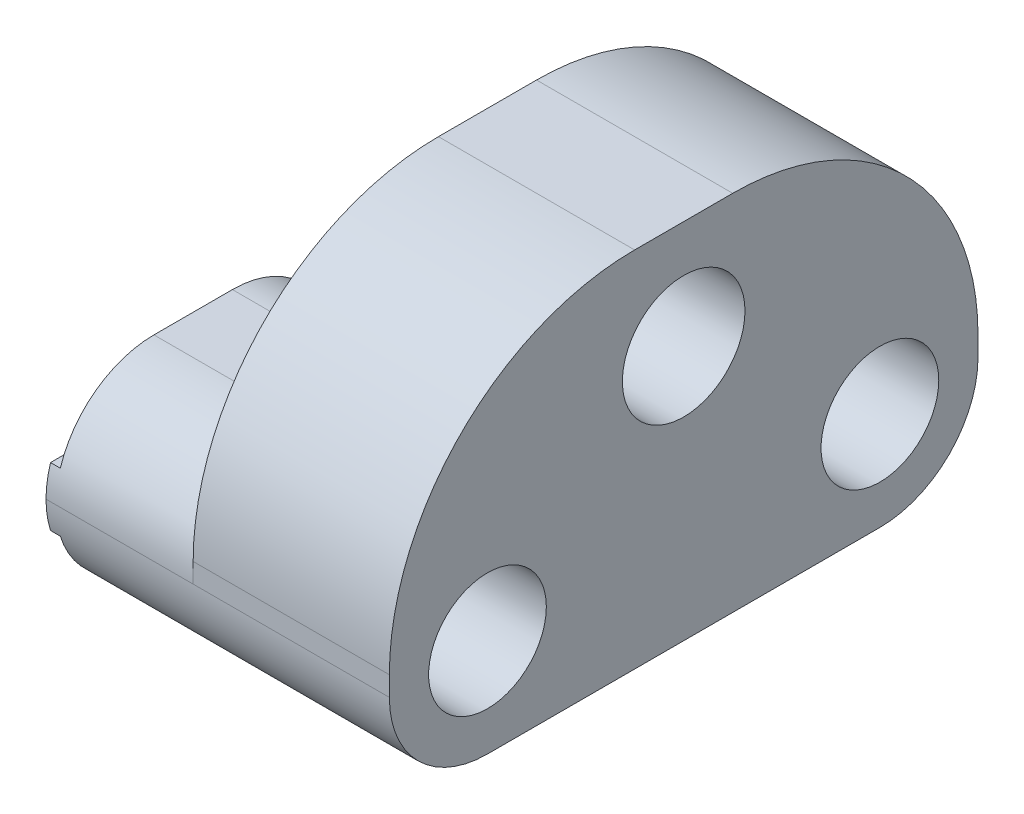
ISO-10303-21;
HEADER;
FILE_DESCRIPTION(('STEP AP214'),'2;1');
FILE_NAME('part.step','',(''),(''),'','','');
FILE_SCHEMA(('AUTOMOTIVE_DESIGN { 1 0 10303 214 1 1 1 1 }'));
ENDSEC;
DATA;
#1=APPLICATION_CONTEXT('core data for automotive mechanical design processes');
#2=APPLICATION_PROTOCOL_DEFINITION('international standard','automotive_design',2000,#1);
#3=PRODUCT_CONTEXT('',#1,'mechanical');
#4=PRODUCT('Part','Part','',(#3));
#5=PRODUCT_RELATED_PRODUCT_CATEGORY('part','',(#4));
#6=PRODUCT_DEFINITION_FORMATION('','',#4);
#7=PRODUCT_DEFINITION_CONTEXT('part definition',#1,'design');
#8=PRODUCT_DEFINITION('design','',#6,#7);
#9=PRODUCT_DEFINITION_SHAPE('','',#8);
#10=(LENGTH_UNIT() NAMED_UNIT(*) SI_UNIT(.MILLI.,.METRE.));
#11=(NAMED_UNIT(*) PLANE_ANGLE_UNIT() SI_UNIT($,.RADIAN.));
#12=(NAMED_UNIT(*) SI_UNIT($,.STERADIAN.) SOLID_ANGLE_UNIT());
#13=UNCERTAINTY_MEASURE_WITH_UNIT(LENGTH_MEASURE(1.E-05),#10,'distance_accuracy_value','');
#14=(GEOMETRIC_REPRESENTATION_CONTEXT(3) GLOBAL_UNCERTAINTY_ASSIGNED_CONTEXT((#13)) GLOBAL_UNIT_ASSIGNED_CONTEXT((#10,
#11,#12)) REPRESENTATION_CONTEXT('',''));
#15=CARTESIAN_POINT('',(0.,0.,0.));
#16=DIRECTION('',(0.,0.,1.));
#17=DIRECTION('',(1.,0.,0.));
#18=AXIS2_PLACEMENT_3D('',#15,#16,#17);
#19=CARTESIAN_POINT('',(0.,20.,60.));
#20=DIRECTION('',(0.,-1.,0.));
#21=DIRECTION('',(0.,0.,-1.));
#22=AXIS2_PLACEMENT_3D('',#19,#20,#21);
#23=PLANE('',#22);
#24=DIRECTION('',(0.,0.,-1.));
#25=VECTOR('',#24,1.);
#26=CARTESIAN_POINT('',(14.,20.,60.));
#27=LINE('',#26,#25);
#28=CARTESIAN_POINT('',(14.,20.,18.));
#29=VERTEX_POINT('',#28);
#30=CARTESIAN_POINT('',(14.,20.,10.));
#31=VERTEX_POINT('',#30);
#32=EDGE_CURVE('E311',#29,#31,#27,.T.);
#33=ORIENTED_EDGE('',*,*,#32,.T.);
#34=DIRECTION('',(-1.,0.,0.));
#35=VECTOR('',#34,1.);
#36=CARTESIAN_POINT('',(0.,20.,10.));
#37=LINE('',#36,#35);
#38=CARTESIAN_POINT('',(0.,20.,10.));
#39=VERTEX_POINT('',#38);
#40=EDGE_CURVE('E258',#31,#39,#37,.T.);
#41=ORIENTED_EDGE('',*,*,#40,.T.);
#42=DIRECTION('',(0.,0.,-1.));
#43=VECTOR('',#42,1.);
#44=CARTESIAN_POINT('',(0.,20.,60.));
#45=LINE('',#44,#43);
#46=CARTESIAN_POINT('',(0.,20.,18.));
#47=VERTEX_POINT('',#46);
#48=EDGE_CURVE('E361',#47,#39,#45,.T.);
#49=ORIENTED_EDGE('',*,*,#48,.F.);
#50=DIRECTION('',(-1.,0.,0.));
#51=VECTOR('',#50,1.);
#52=CARTESIAN_POINT('',(14.,20.,18.));
#53=LINE('',#52,#51);
#54=EDGE_CURVE('E210',#47,#29,#53,.F.);
#55=ORIENTED_EDGE('',*,*,#54,.T.);
#56=EDGE_LOOP('',(#33,#41,#49,#55));
#57=FACE_BOUND('',#56,.T.);
#58=ADVANCED_FACE('F39',(#57),#23,.F.);
#59=CARTESIAN_POINT('',(0.,20.,50.));
#60=VERTEX_POINT('',#59);
#61=CARTESIAN_POINT('',(0.,20.,42.));
#62=VERTEX_POINT('',#61);
#63=EDGE_CURVE('E177',#60,#62,#45,.T.);
#64=ORIENTED_EDGE('',*,*,#63,.F.);
#65=DIRECTION('',(-1.,0.,0.));
#66=VECTOR('',#65,1.);
#67=CARTESIAN_POINT('',(0.,20.,50.));
#68=LINE('',#67,#66);
#69=CARTESIAN_POINT('',(14.,20.,50.));
#70=VERTEX_POINT('',#69);
#71=EDGE_CURVE('E253',#60,#70,#68,.F.);
#72=ORIENTED_EDGE('',*,*,#71,.T.);
#73=CARTESIAN_POINT('',(14.,20.,42.));
#74=VERTEX_POINT('',#73);
#75=EDGE_CURVE('E308',#70,#74,#27,.T.);
#76=ORIENTED_EDGE('',*,*,#75,.T.);
#77=DIRECTION('',(-1.,0.,0.));
#78=VECTOR('',#77,1.);
#79=CARTESIAN_POINT('',(0.,20.,42.));
#80=LINE('',#79,#78);
#81=EDGE_CURVE('E212',#74,#62,#80,.T.);
#82=ORIENTED_EDGE('',*,*,#81,.T.);
#83=EDGE_LOOP('',(#64,#72,#76,#82));
#84=FACE_BOUND('',#83,.T.);
#85=ADVANCED_FACE('F423',(#84),#23,.F.);
#86=CARTESIAN_POINT('',(-1.001,26.,30.));
#87=DIRECTION('',(1.,0.,0.));
#88=DIRECTION('',(0.,0.,-1.));
#89=AXIS2_PLACEMENT_3D('',#86,#87,#88);
#90=CYLINDRICAL_SURFACE('',#89,6.25);
#91=CARTESIAN_POINT('',(34.,26.,30.));
#92=DIRECTION('',(1.,0.,0.));
#93=DIRECTION('',(0.,0.,-1.));
#94=AXIS2_PLACEMENT_3D('',#91,#92,#93);
#95=CIRCLE('',#94,6.25);
#96=CARTESIAN_POINT('',(34.,26.,23.75));
#97=VERTEX_POINT('',#96);
#98=EDGE_CURVE('E193',#97,#97,#95,.T.);
#99=ORIENTED_EDGE('',*,*,#98,.T.);
#100=EDGE_LOOP('',(#99));
#101=FACE_BOUND('',#100,.T.);
#102=CARTESIAN_POINT('',(14.,26.,30.));
#103=DIRECTION('',(1.,0.,0.));
#104=DIRECTION('',(0.,0.,-1.));
#105=AXIS2_PLACEMENT_3D('',#102,#103,#104);
#106=CIRCLE('',#105,6.25);
#107=CARTESIAN_POINT('',(14.,26.,23.75));
#108=VERTEX_POINT('',#107);
#109=EDGE_CURVE('E330',#108,#108,#106,.F.);
#110=ORIENTED_EDGE('',*,*,#109,.T.);
#111=EDGE_LOOP('',(#110));
#112=FACE_BOUND('',#111,.T.);
#113=ADVANCED_FACE('F429',(#101,#112),#90,.F.);
#114=CARTESIAN_POINT('',(-8.77817459305202,10.,10.));
#115=DIRECTION('',(1.,0.,0.));
#116=DIRECTION('',(0.,0.,-1.));
#117=AXIS2_PLACEMENT_3D('',#114,#115,#116);
#118=CYLINDRICAL_SURFACE('',#117,2.75);
#119=CARTESIAN_POINT('',(-1.,10.,10.));
#120=DIRECTION('',(1.,0.,0.));
#121=DIRECTION('',(0.,0.,-1.));
#122=AXIS2_PLACEMENT_3D('',#119,#120,#121);
#123=CIRCLE('',#122,2.75);
#124=CARTESIAN_POINT('',(-1.,10.,7.25));
#125=VERTEX_POINT('',#124);
#126=EDGE_CURVE('E320',#125,#125,#123,.F.);
#127=ORIENTED_EDGE('',*,*,#126,.T.);
#128=EDGE_LOOP('',(#127));
#129=FACE_BOUND('',#128,.T.);
#130=CARTESIAN_POINT('',(6.,10.,10.));
#131=DIRECTION('',(1.,0.,0.));
#132=DIRECTION('',(0.,0.,-1.));
#133=AXIS2_PLACEMENT_3D('',#130,#131,#132);
#134=CIRCLE('',#133,2.75);
#135=CARTESIAN_POINT('',(6.,10.,7.25));
#136=VERTEX_POINT('',#135);
#137=EDGE_CURVE('E206',#136,#136,#134,.F.);
#138=ORIENTED_EDGE('',*,*,#137,.F.);
#139=EDGE_LOOP('',(#138));
#140=FACE_BOUND('',#139,.T.);
#141=ADVANCED_FACE('F541',(#129,#140),#118,.F.);
#142=CARTESIAN_POINT('',(-8.77817459305202,10.,50.));
#143=DIRECTION('',(1.,0.,0.));
#144=DIRECTION('',(0.,0.,-1.));
#145=AXIS2_PLACEMENT_3D('',#142,#143,#144);
#146=CYLINDRICAL_SURFACE('',#145,2.75);
#147=CARTESIAN_POINT('',(-1.,10.,50.));
#148=DIRECTION('',(1.,0.,0.));
#149=DIRECTION('',(0.,0.,-1.));
#150=AXIS2_PLACEMENT_3D('',#147,#148,#149);
#151=CIRCLE('',#150,2.75);
#152=CARTESIAN_POINT('',(-1.,10.,47.25));
#153=VERTEX_POINT('',#152);
#154=EDGE_CURVE('E338',#153,#153,#151,.F.);
#155=ORIENTED_EDGE('',*,*,#154,.T.);
#156=EDGE_LOOP('',(#155));
#157=FACE_BOUND('',#156,.T.);
#158=CARTESIAN_POINT('',(6.,10.,50.));
#159=DIRECTION('',(1.,0.,0.));
#160=DIRECTION('',(0.,0.,-1.));
#161=AXIS2_PLACEMENT_3D('',#158,#159,#160);
#162=CIRCLE('',#161,2.75);
#163=CARTESIAN_POINT('',(6.,10.,47.25));
#164=VERTEX_POINT('',#163);
#165=EDGE_CURVE('E314',#164,#164,#162,.F.);
#166=ORIENTED_EDGE('',*,*,#165,.F.);
#167=EDGE_LOOP('',(#166));
#168=FACE_BOUND('',#167,.T.);
#169=ADVANCED_FACE('F443',(#157,#168),#146,.F.);
#170=CARTESIAN_POINT('',(34.,0.,60.));
#171=DIRECTION('',(0.,1.,0.));
#172=DIRECTION('',(-1.,0.,0.));
#173=AXIS2_PLACEMENT_3D('',#170,#171,#172);
#174=PLANE('',#173);
#175=DIRECTION('',(0.,0.,-1.));
#176=VECTOR('',#175,1.);
#177=CARTESIAN_POINT('',(34.,0.,60.));
#178=LINE('',#177,#176);
#179=CARTESIAN_POINT('',(34.,0.,50.));
#180=VERTEX_POINT('',#179);
#181=CARTESIAN_POINT('',(34.,0.,10.));
#182=VERTEX_POINT('',#181);
#183=EDGE_CURVE('E199',#180,#182,#178,.T.);
#184=ORIENTED_EDGE('',*,*,#183,.F.);
#185=DIRECTION('',(1.,0.,0.));
#186=VECTOR('',#185,1.);
#187=CARTESIAN_POINT('',(34.,0.,50.));
#188=LINE('',#187,#186);
#189=CARTESIAN_POINT('',(0.,0.,50.));
#190=VERTEX_POINT('',#189);
#191=EDGE_CURVE('E227',#180,#190,#188,.F.);
#192=ORIENTED_EDGE('',*,*,#191,.T.);
#193=DIRECTION('',(0.,0.,-1.));
#194=VECTOR('',#193,1.);
#195=CARTESIAN_POINT('',(0.,0.,60.));
#196=LINE('',#195,#194);
#197=CARTESIAN_POINT('',(0.,0.,10.));
#198=VERTEX_POINT('',#197);
#199=EDGE_CURVE('E345',#190,#198,#196,.T.);
#200=ORIENTED_EDGE('',*,*,#199,.T.);
#201=DIRECTION('',(1.,0.,0.));
#202=VECTOR('',#201,1.);
#203=CARTESIAN_POINT('',(34.,0.,10.));
#204=LINE('',#203,#202);
#205=EDGE_CURVE('E224',#198,#182,#204,.T.);
#206=ORIENTED_EDGE('',*,*,#205,.T.);
#207=EDGE_LOOP('',(#184,#192,#200,#206));
#208=FACE_BOUND('',#207,.T.);
#209=ADVANCED_FACE('F396',(#208),#174,.F.);
#210=CARTESIAN_POINT('',(34.,37.,60.));
#211=DIRECTION('',(-1.,0.,0.));
#212=DIRECTION('',(0.,0.,1.));
#213=AXIS2_PLACEMENT_3D('',#210,#211,#212);
#214=PLANE('',#213);
#215=ORIENTED_EDGE('',*,*,#98,.F.);
#216=EDGE_LOOP('',(#215));
#217=FACE_BOUND('',#216,.T.);
#218=CARTESIAN_POINT('',(34.,10.,50.));
#219=DIRECTION('',(1.,0.,0.));
#220=DIRECTION('',(0.,0.,-1.));
#221=AXIS2_PLACEMENT_3D('',#218,#219,#220);
#222=CIRCLE('',#221,5.99999999999999);
#223=CARTESIAN_POINT('',(34.,10.,44.));
#224=VERTEX_POINT('',#223);
#225=EDGE_CURVE('E322',#224,#224,#222,.T.);
#226=ORIENTED_EDGE('',*,*,#225,.F.);
#227=EDGE_LOOP('',(#226));
#228=FACE_BOUND('',#227,.T.);
#229=CARTESIAN_POINT('',(34.,10.,10.));
#230=DIRECTION('',(1.,0.,0.));
#231=DIRECTION('',(0.,0.,-1.));
#232=AXIS2_PLACEMENT_3D('',#229,#230,#231);
#233=CIRCLE('',#232,6.);
#234=CARTESIAN_POINT('',(34.,10.,4.));
#235=VERTEX_POINT('',#234);
#236=EDGE_CURVE('E327',#235,#235,#233,.T.);
#237=ORIENTED_EDGE('',*,*,#236,.F.);
#238=EDGE_LOOP('',(#237));
#239=FACE_BOUND('',#238,.T.);
#240=DIRECTION('',(0.,0.,-1.));
#241=VECTOR('',#240,1.);
#242=CARTESIAN_POINT('',(34.,37.,60.));
#243=LINE('',#242,#241);
#244=CARTESIAN_POINT('',(34.,37.,35.));
#245=VERTEX_POINT('',#244);
#246=CARTESIAN_POINT('',(34.,37.,25.));
#247=VERTEX_POINT('',#246);
#248=EDGE_CURVE('E203',#245,#247,#243,.T.);
#249=ORIENTED_EDGE('',*,*,#248,.F.);
#250=CARTESIAN_POINT('',(34.,12.,35.));
#251=DIRECTION('',(-1.,0.,0.));
#252=DIRECTION('',(0.,0.,1.));
#253=AXIS2_PLACEMENT_3D('',#250,#251,#252);
#254=CIRCLE('',#253,25.);
#255=CARTESIAN_POINT('',(34.,12.,60.));
#256=VERTEX_POINT('',#255);
#257=EDGE_CURVE('E47',#245,#256,#254,.F.);
#258=ORIENTED_EDGE('',*,*,#257,.T.);
#259=DIRECTION('',(0.,1.,0.));
#260=VECTOR('',#259,1.);
#261=CARTESIAN_POINT('',(34.,37.,60.));
#262=LINE('',#261,#260);
#263=CARTESIAN_POINT('',(34.,10.,60.));
#264=VERTEX_POINT('',#263);
#265=EDGE_CURVE('E287',#264,#256,#262,.T.);
#266=ORIENTED_EDGE('',*,*,#265,.F.);
#267=CARTESIAN_POINT('',(34.,10.,50.));
#268=DIRECTION('',(-1.,0.,0.));
#269=DIRECTION('',(0.,0.,1.));
#270=AXIS2_PLACEMENT_3D('',#267,#268,#269);
#271=CIRCLE('',#270,10.);
#272=EDGE_CURVE('E222',#264,#180,#271,.F.);
#273=ORIENTED_EDGE('',*,*,#272,.T.);
#274=ORIENTED_EDGE('',*,*,#183,.T.);
#275=CARTESIAN_POINT('',(34.,10.,10.));
#276=DIRECTION('',(-1.,0.,0.));
#277=DIRECTION('',(0.,0.,1.));
#278=AXIS2_PLACEMENT_3D('',#275,#276,#277);
#279=CIRCLE('',#278,10.);
#280=CARTESIAN_POINT('',(34.,10.,0.));
#281=VERTEX_POINT('',#280);
#282=EDGE_CURVE('E220',#182,#281,#279,.F.);
#283=ORIENTED_EDGE('',*,*,#282,.T.);
#284=DIRECTION('',(0.,1.,0.));
#285=VECTOR('',#284,1.);
#286=CARTESIAN_POINT('',(34.,37.,0.));
#287=LINE('',#286,#285);
#288=CARTESIAN_POINT('',(34.,12.,0.));
#289=VERTEX_POINT('',#288);
#290=EDGE_CURVE('E341',#281,#289,#287,.T.);
#291=ORIENTED_EDGE('',*,*,#290,.T.);
#292=CARTESIAN_POINT('',(34.,12.,25.));
#293=DIRECTION('',(-1.,0.,0.));
#294=DIRECTION('',(0.,0.,1.));
#295=AXIS2_PLACEMENT_3D('',#292,#293,#294);
#296=CIRCLE('',#295,25.);
#297=EDGE_CURVE('E59',#289,#247,#296,.F.);
#298=ORIENTED_EDGE('',*,*,#297,.T.);
#299=EDGE_LOOP('',(#249,#258,#266,#273,#274,#283,#291,#298));
#300=FACE_BOUND('',#299,.T.);
#301=ADVANCED_FACE('F286',(#217,#228,#239,#300),#214,.F.);
#302=CARTESIAN_POINT('',(14.,37.,60.));
#303=DIRECTION('',(0.,-1.,0.));
#304=DIRECTION('',(1.,0.,0.));
#305=AXIS2_PLACEMENT_3D('',#302,#303,#304);
#306=PLANE('',#305);
#307=DIRECTION('',(0.,0.,-1.));
#308=VECTOR('',#307,1.);
#309=CARTESIAN_POINT('',(14.,37.,60.));
#310=LINE('',#309,#308);
#311=CARTESIAN_POINT('',(14.,37.,35.));
#312=VERTEX_POINT('',#311);
#313=CARTESIAN_POINT('',(14.,37.,25.));
#314=VERTEX_POINT('',#313);
#315=EDGE_CURVE('E304',#312,#314,#310,.T.);
#316=ORIENTED_EDGE('',*,*,#315,.F.);
#317=DIRECTION('',(-1.,0.,0.));
#318=VECTOR('',#317,1.);
#319=CARTESIAN_POINT('',(14.,37.,35.));
#320=LINE('',#319,#318);
#321=EDGE_CURVE('E281',#312,#245,#320,.F.);
#322=ORIENTED_EDGE('',*,*,#321,.T.);
#323=ORIENTED_EDGE('',*,*,#248,.T.);
#324=DIRECTION('',(-1.,0.,0.));
#325=VECTOR('',#324,1.);
#326=CARTESIAN_POINT('',(14.,37.,25.));
#327=LINE('',#326,#325);
#328=EDGE_CURVE('E278',#247,#314,#327,.T.);
#329=ORIENTED_EDGE('',*,*,#328,.T.);
#330=EDGE_LOOP('',(#316,#322,#323,#329));
#331=FACE_BOUND('',#330,.T.);
#332=ADVANCED_FACE('F306',(#331),#306,.F.);
#333=CARTESIAN_POINT('',(14.,20.,60.));
#334=DIRECTION('',(1.,0.,0.));
#335=DIRECTION('',(0.,0.,-1.));
#336=AXIS2_PLACEMENT_3D('',#333,#334,#335);
#337=PLANE('',#336);
#338=DIRECTION('',(0.,-1.,0.));
#339=VECTOR('',#338,1.);
#340=CARTESIAN_POINT('',(14.,20.,60.));
#341=LINE('',#340,#339);
#342=CARTESIAN_POINT('',(14.,12.,60.));
#343=VERTEX_POINT('',#342);
#344=CARTESIAN_POINT('',(14.,10.,60.));
#345=VERTEX_POINT('',#344);
#346=EDGE_CURVE('E295',#343,#345,#341,.T.);
#347=ORIENTED_EDGE('',*,*,#346,.F.);
#348=CARTESIAN_POINT('',(14.,12.,35.));
#349=DIRECTION('',(1.,0.,0.));
#350=DIRECTION('',(0.,0.,-1.));
#351=AXIS2_PLACEMENT_3D('',#348,#349,#350);
#352=CIRCLE('',#351,25.);
#353=EDGE_CURVE('E276',#343,#312,#352,.F.);
#354=ORIENTED_EDGE('',*,*,#353,.T.);
#355=ORIENTED_EDGE('',*,*,#315,.T.);
#356=CARTESIAN_POINT('',(14.,12.,25.));
#357=DIRECTION('',(1.,0.,0.));
#358=DIRECTION('',(0.,0.,-1.));
#359=AXIS2_PLACEMENT_3D('',#356,#357,#358);
#360=CIRCLE('',#359,25.);
#361=CARTESIAN_POINT('',(14.,12.,0.));
#362=VERTEX_POINT('',#361);
#363=EDGE_CURVE('E274',#314,#362,#360,.F.);
#364=ORIENTED_EDGE('',*,*,#363,.T.);
#365=DIRECTION('',(0.,-1.,0.));
#366=VECTOR('',#365,1.);
#367=CARTESIAN_POINT('',(14.,20.,0.));
#368=LINE('',#367,#366);
#369=CARTESIAN_POINT('',(14.,10.,0.));
#370=VERTEX_POINT('',#369);
#371=EDGE_CURVE('E296',#362,#370,#368,.T.);
#372=ORIENTED_EDGE('',*,*,#371,.T.);
#373=CARTESIAN_POINT('',(14.,10.,10.));
#374=DIRECTION('',(1.,0.,0.));
#375=DIRECTION('',(0.,0.,-1.));
#376=AXIS2_PLACEMENT_3D('',#373,#374,#375);
#377=CIRCLE('',#376,10.);
#378=EDGE_CURVE('E263',#370,#31,#377,.T.);
#379=ORIENTED_EDGE('',*,*,#378,.T.);
#380=ORIENTED_EDGE('',*,*,#32,.F.);
#381=CARTESIAN_POINT('',(14.,10.,18.));
#382=DIRECTION('',(1.,0.,0.));
#383=DIRECTION('',(0.,0.,-1.));
#384=AXIS2_PLACEMENT_3D('',#381,#382,#383);
#385=CIRCLE('',#384,10.);
#386=CARTESIAN_POINT('',(14.,18.,24.));
#387=VERTEX_POINT('',#386);
#388=EDGE_CURVE('E214',#29,#387,#385,.T.);
#389=ORIENTED_EDGE('',*,*,#388,.T.);
#390=CARTESIAN_POINT('',(14.,26.,30.));
#391=DIRECTION('',(-1.,0.,0.));
#392=DIRECTION('',(0.,0.,1.));
#393=AXIS2_PLACEMENT_3D('',#390,#391,#392);
#394=CIRCLE('',#393,10.);
#395=CARTESIAN_POINT('',(14.,18.,36.));
#396=VERTEX_POINT('',#395);
#397=EDGE_CURVE('E194',#387,#396,#394,.T.);
#398=ORIENTED_EDGE('',*,*,#397,.T.);
#399=CARTESIAN_POINT('',(14.,10.,42.));
#400=DIRECTION('',(1.,0.,0.));
#401=DIRECTION('',(0.,0.,-1.));
#402=AXIS2_PLACEMENT_3D('',#399,#400,#401);
#403=CIRCLE('',#402,10.);
#404=EDGE_CURVE('E198',#396,#74,#403,.T.);
#405=ORIENTED_EDGE('',*,*,#404,.T.);
#406=ORIENTED_EDGE('',*,*,#75,.F.);
#407=CARTESIAN_POINT('',(14.,10.,50.));
#408=DIRECTION('',(1.,0.,0.));
#409=DIRECTION('',(0.,0.,-1.));
#410=AXIS2_PLACEMENT_3D('',#407,#408,#409);
#411=CIRCLE('',#410,10.);
#412=EDGE_CURVE('E260',#70,#345,#411,.T.);
#413=ORIENTED_EDGE('',*,*,#412,.T.);
#414=EDGE_LOOP('',(#347,#354,#355,#364,#372,#379,#380,#389,#398,#405,#406,#413));
#415=FACE_BOUND('',#414,.T.);
#416=ORIENTED_EDGE('',*,*,#109,.F.);
#417=EDGE_LOOP('',(#416));
#418=FACE_BOUND('',#417,.T.);
#419=ADVANCED_FACE('F302',(#415,#418),#337,.F.);
#420=CARTESIAN_POINT('',(0.,13.,60.));
#421=DIRECTION('',(1.,0.,0.));
#422=DIRECTION('',(0.,0.,-1.));
#423=AXIS2_PLACEMENT_3D('',#420,#421,#422);
#424=PLANE('',#423);
#425=DIRECTION('',(0.,0.,-1.));
#426=VECTOR('',#425,1.);
#427=CARTESIAN_POINT('',(0.,13.,60.));
#428=LINE('',#427,#426);
#429=CARTESIAN_POINT('',(0.,13.,59.5393920141695));
#430=VERTEX_POINT('',#429);
#431=CARTESIAN_POINT('',(0.,13.,0.460607985830544));
#432=VERTEX_POINT('',#431);
#433=EDGE_CURVE('E359',#430,#432,#428,.T.);
#434=ORIENTED_EDGE('',*,*,#433,.F.);
#435=CARTESIAN_POINT('',(0.,10.,50.));
#436=DIRECTION('',(1.,0.,0.));
#437=DIRECTION('',(0.,0.,-1.));
#438=AXIS2_PLACEMENT_3D('',#435,#436,#437);
#439=CIRCLE('',#438,10.);
#440=EDGE_CURVE('E251',#430,#60,#439,.F.);
#441=ORIENTED_EDGE('',*,*,#440,.T.);
#442=ORIENTED_EDGE('',*,*,#63,.T.);
#443=CARTESIAN_POINT('',(0.,10.,42.));
#444=DIRECTION('',(1.,0.,0.));
#445=DIRECTION('',(0.,0.,-1.));
#446=AXIS2_PLACEMENT_3D('',#443,#444,#445);
#447=CIRCLE('',#446,10.);
#448=CARTESIAN_POINT('',(0.,18.,36.));
#449=VERTEX_POINT('',#448);
#450=EDGE_CURVE('E171',#62,#449,#447,.F.);
#451=ORIENTED_EDGE('',*,*,#450,.T.);
#452=CARTESIAN_POINT('',(0.,26.,30.));
#453=DIRECTION('',(1.,0.,0.));
#454=DIRECTION('',(0.,0.,-1.));
#455=AXIS2_PLACEMENT_3D('',#452,#453,#454);
#456=CIRCLE('',#455,10.);
#457=CARTESIAN_POINT('',(0.,18.,24.));
#458=VERTEX_POINT('',#457);
#459=EDGE_CURVE('E175',#449,#458,#456,.T.);
#460=ORIENTED_EDGE('',*,*,#459,.T.);
#461=CARTESIAN_POINT('',(0.,10.,18.));
#462=DIRECTION('',(1.,0.,0.));
#463=DIRECTION('',(0.,0.,-1.));
#464=AXIS2_PLACEMENT_3D('',#461,#462,#463);
#465=CIRCLE('',#464,10.);
#466=EDGE_CURVE('E182',#458,#47,#465,.F.);
#467=ORIENTED_EDGE('',*,*,#466,.T.);
#468=ORIENTED_EDGE('',*,*,#48,.T.);
#469=CARTESIAN_POINT('',(0.,10.,10.));
#470=DIRECTION('',(1.,0.,0.));
#471=DIRECTION('',(0.,0.,-1.));
#472=AXIS2_PLACEMENT_3D('',#469,#470,#471);
#473=CIRCLE('',#472,10.);
#474=EDGE_CURVE('E249',#39,#432,#473,.F.);
#475=ORIENTED_EDGE('',*,*,#474,.T.);
#476=EDGE_LOOP('',(#434,#441,#442,#451,#460,#467,#468,#475));
#477=FACE_BOUND('',#476,.T.);
#478=ADVANCED_FACE('F174',(#477),#424,.F.);
#479=CARTESIAN_POINT('',(-1.,13.,60.));
#480=DIRECTION('',(0.,-1.,0.));
#481=DIRECTION('',(0.,0.,-1.));
#482=AXIS2_PLACEMENT_3D('',#479,#480,#481);
#483=PLANE('',#482);
#484=DIRECTION('',(0.,0.,-1.));
#485=VECTOR('',#484,1.);
#486=CARTESIAN_POINT('',(-1.,13.,60.));
#487=LINE('',#486,#485);
#488=CARTESIAN_POINT('',(-1.,13.,59.5393920141695));
#489=VERTEX_POINT('',#488);
#490=CARTESIAN_POINT('',(-1.,13.,0.460607985830544));
#491=VERTEX_POINT('',#490);
#492=EDGE_CURVE('E356',#489,#491,#487,.T.);
#493=ORIENTED_EDGE('',*,*,#492,.F.);
#494=DIRECTION('',(-1.,0.,0.));
#495=VECTOR('',#494,1.);
#496=CARTESIAN_POINT('',(-1.,13.,59.5393920141695));
#497=LINE('',#496,#495);
#498=EDGE_CURVE('E247',#489,#430,#497,.F.);
#499=ORIENTED_EDGE('',*,*,#498,.T.);
#500=ORIENTED_EDGE('',*,*,#433,.T.);
#501=DIRECTION('',(1.,0.,0.));
#502=VECTOR('',#501,1.);
#503=CARTESIAN_POINT('',(0.,13.,0.460607985830544));
#504=LINE('',#503,#502);
#505=EDGE_CURVE('E245',#432,#491,#504,.F.);
#506=ORIENTED_EDGE('',*,*,#505,.T.);
#507=EDGE_LOOP('',(#493,#499,#500,#506));
#508=FACE_BOUND('',#507,.T.);
#509=ADVANCED_FACE('F377',(#508),#483,.F.);
#510=CARTESIAN_POINT('',(-1.,7.,60.));
#511=DIRECTION('',(1.,0.,0.));
#512=DIRECTION('',(0.,0.,-1.));
#513=AXIS2_PLACEMENT_3D('',#510,#511,#512);
#514=PLANE('',#513);
#515=ORIENTED_EDGE('',*,*,#154,.F.);
#516=EDGE_LOOP('',(#515));
#517=FACE_BOUND('',#516,.T.);
#518=ORIENTED_EDGE('',*,*,#126,.F.);
#519=EDGE_LOOP('',(#518));
#520=FACE_BOUND('',#519,.T.);
#521=DIRECTION('',(0.,0.,-1.));
#522=VECTOR('',#521,1.);
#523=CARTESIAN_POINT('',(-1.,7.,60.));
#524=LINE('',#523,#522);
#525=CARTESIAN_POINT('',(-1.,7.,59.5393920141695));
#526=VERTEX_POINT('',#525);
#527=CARTESIAN_POINT('',(-1.,7.,0.460607985830544));
#528=VERTEX_POINT('',#527);
#529=EDGE_CURVE('E353',#526,#528,#524,.T.);
#530=ORIENTED_EDGE('',*,*,#529,.F.);
#531=CARTESIAN_POINT('',(-1.,10.,50.));
#532=DIRECTION('',(1.,0.,0.));
#533=DIRECTION('',(0.,0.,-1.));
#534=AXIS2_PLACEMENT_3D('',#531,#532,#533);
#535=CIRCLE('',#534,10.);
#536=CARTESIAN_POINT('',(-1.,10.,60.));
#537=VERTEX_POINT('',#536);
#538=EDGE_CURVE('E243',#526,#537,#535,.F.);
#539=ORIENTED_EDGE('',*,*,#538,.T.);
#540=CARTESIAN_POINT('',(-1.,10.,50.));
#541=DIRECTION('',(1.,0.,0.));
#542=DIRECTION('',(0.,0.,-1.));
#543=AXIS2_PLACEMENT_3D('',#540,#541,#542);
#544=CIRCLE('',#543,10.);
#545=EDGE_CURVE('E241',#537,#489,#544,.F.);
#546=ORIENTED_EDGE('',*,*,#545,.T.);
#547=ORIENTED_EDGE('',*,*,#492,.T.);
#548=CARTESIAN_POINT('',(-1.,10.,10.));
#549=DIRECTION('',(1.,0.,0.));
#550=DIRECTION('',(0.,0.,-1.));
#551=AXIS2_PLACEMENT_3D('',#548,#549,#550);
#552=CIRCLE('',#551,10.);
#553=CARTESIAN_POINT('',(-1.,10.,0.));
#554=VERTEX_POINT('',#553);
#555=EDGE_CURVE('E237',#491,#554,#552,.F.);
#556=ORIENTED_EDGE('',*,*,#555,.T.);
#557=CARTESIAN_POINT('',(-1.,10.,10.));
#558=DIRECTION('',(1.,0.,0.));
#559=DIRECTION('',(0.,0.,-1.));
#560=AXIS2_PLACEMENT_3D('',#557,#558,#559);
#561=CIRCLE('',#560,10.);
#562=EDGE_CURVE('E239',#554,#528,#561,.F.);
#563=ORIENTED_EDGE('',*,*,#562,.T.);
#564=EDGE_LOOP('',(#530,#539,#546,#547,#556,#563));
#565=FACE_BOUND('',#564,.T.);
#566=ADVANCED_FACE('F381',(#517,#520,#565),#514,.F.);
#567=CARTESIAN_POINT('',(0.,7.,60.));
#568=DIRECTION('',(0.,1.,0.));
#569=DIRECTION('',(-1.,0.,0.));
#570=AXIS2_PLACEMENT_3D('',#567,#568,#569);
#571=PLANE('',#570);
#572=DIRECTION('',(0.,0.,-1.));
#573=VECTOR('',#572,1.);
#574=CARTESIAN_POINT('',(0.,7.,60.));
#575=LINE('',#574,#573);
#576=CARTESIAN_POINT('',(0.,7.,59.5393920141695));
#577=VERTEX_POINT('',#576);
#578=CARTESIAN_POINT('',(0.,7.,0.460607985830544));
#579=VERTEX_POINT('',#578);
#580=EDGE_CURVE('E350',#577,#579,#575,.T.);
#581=ORIENTED_EDGE('',*,*,#580,.F.);
#582=DIRECTION('',(1.,0.,0.));
#583=VECTOR('',#582,1.);
#584=CARTESIAN_POINT('',(0.,7.,59.5393920141695));
#585=LINE('',#584,#583);
#586=EDGE_CURVE('E235',#577,#526,#585,.F.);
#587=ORIENTED_EDGE('',*,*,#586,.T.);
#588=ORIENTED_EDGE('',*,*,#529,.T.);
#589=DIRECTION('',(-1.,0.,0.));
#590=VECTOR('',#589,1.);
#591=CARTESIAN_POINT('',(-1.,7.,0.460607985830544));
#592=LINE('',#591,#590);
#593=EDGE_CURVE('E233',#528,#579,#592,.F.);
#594=ORIENTED_EDGE('',*,*,#593,.T.);
#595=EDGE_LOOP('',(#581,#587,#588,#594));
#596=FACE_BOUND('',#595,.T.);
#597=ADVANCED_FACE('F409',(#596),#571,.F.);
#598=CARTESIAN_POINT('',(0.,0.,60.));
#599=DIRECTION('',(1.,0.,0.));
#600=DIRECTION('',(0.,0.,-1.));
#601=AXIS2_PLACEMENT_3D('',#598,#599,#600);
#602=PLANE('',#601);
#603=ORIENTED_EDGE('',*,*,#199,.F.);
#604=CARTESIAN_POINT('',(0.,10.,50.));
#605=DIRECTION('',(1.,0.,0.));
#606=DIRECTION('',(0.,0.,-1.));
#607=AXIS2_PLACEMENT_3D('',#604,#605,#606);
#608=CIRCLE('',#607,10.);
#609=EDGE_CURVE('E231',#190,#577,#608,.F.);
#610=ORIENTED_EDGE('',*,*,#609,.T.);
#611=ORIENTED_EDGE('',*,*,#580,.T.);
#612=CARTESIAN_POINT('',(0.,10.,10.));
#613=DIRECTION('',(1.,0.,0.));
#614=DIRECTION('',(0.,0.,-1.));
#615=AXIS2_PLACEMENT_3D('',#612,#613,#614);
#616=CIRCLE('',#615,10.);
#617=EDGE_CURVE('E229',#579,#198,#616,.F.);
#618=ORIENTED_EDGE('',*,*,#617,.T.);
#619=EDGE_LOOP('',(#603,#610,#611,#618));
#620=FACE_BOUND('',#619,.T.);
#621=ADVANCED_FACE('F411',(#620),#602,.F.);
#622=CARTESIAN_POINT('',(0.,0.,60.));
#623=DIRECTION('',(0.,0.,-1.));
#624=DIRECTION('',(-1.,0.,0.));
#625=AXIS2_PLACEMENT_3D('',#622,#623,#624);
#626=PLANE('',#625);
#627=ORIENTED_EDGE('',*,*,#265,.T.);
#628=DIRECTION('',(-1.,0.,0.));
#629=VECTOR('',#628,1.);
#630=CARTESIAN_POINT('',(0.,12.,60.));
#631=LINE('',#630,#629);
#632=EDGE_CURVE('E265',#256,#343,#631,.T.);
#633=ORIENTED_EDGE('',*,*,#632,.T.);
#634=ORIENTED_EDGE('',*,*,#346,.T.);
#635=DIRECTION('',(1.,0.,0.));
#636=VECTOR('',#635,1.);
#637=CARTESIAN_POINT('',(0.,10.,60.));
#638=LINE('',#637,#636);
#639=EDGE_CURVE('E217',#345,#264,#638,.T.);
#640=ORIENTED_EDGE('',*,*,#639,.T.);
#641=EDGE_LOOP('',(#627,#633,#634,#640));
#642=FACE_BOUND('',#641,.T.);
#643=ADVANCED_FACE('F292',(#642),#626,.F.);
#644=CARTESIAN_POINT('',(0.,0.,0.));
#645=DIRECTION('',(0.,0.,-1.));
#646=DIRECTION('',(-1.,0.,0.));
#647=AXIS2_PLACEMENT_3D('',#644,#645,#646);
#648=PLANE('',#647);
#649=ORIENTED_EDGE('',*,*,#371,.F.);
#650=DIRECTION('',(-1.,0.,0.));
#651=VECTOR('',#650,1.);
#652=CARTESIAN_POINT('',(34.,12.,0.));
#653=LINE('',#652,#651);
#654=EDGE_CURVE('E11',#362,#289,#653,.F.);
#655=ORIENTED_EDGE('',*,*,#654,.T.);
#656=ORIENTED_EDGE('',*,*,#290,.F.);
#657=DIRECTION('',(1.,0.,0.));
#658=VECTOR('',#657,1.);
#659=CARTESIAN_POINT('',(0.,10.,0.));
#660=LINE('',#659,#658);
#661=EDGE_CURVE('E255',#281,#370,#660,.F.);
#662=ORIENTED_EDGE('',*,*,#661,.T.);
#663=EDGE_LOOP('',(#649,#655,#656,#662));
#664=FACE_BOUND('',#663,.T.);
#665=ADVANCED_FACE('F404',(#664),#648,.T.);
#666=CARTESIAN_POINT('',(6.,10.,50.));
#667=DIRECTION('',(1.,0.,0.));
#668=DIRECTION('',(0.,0.,-1.));
#669=AXIS2_PLACEMENT_3D('',#666,#667,#668);
#670=PLANE('',#669);
#671=CARTESIAN_POINT('',(6.,10.,50.));
#672=DIRECTION('',(1.,0.,0.));
#673=DIRECTION('',(0.,0.,-1.));
#674=AXIS2_PLACEMENT_3D('',#671,#672,#673);
#675=CIRCLE('',#674,5.99999999999999);
#676=CARTESIAN_POINT('',(6.,10.,44.));
#677=VERTEX_POINT('',#676);
#678=EDGE_CURVE('E316',#677,#677,#675,.T.);
#679=ORIENTED_EDGE('',*,*,#678,.T.);
#680=EDGE_LOOP('',(#679));
#681=FACE_BOUND('',#680,.T.);
#682=ORIENTED_EDGE('',*,*,#165,.T.);
#683=EDGE_LOOP('',(#682));
#684=FACE_BOUND('',#683,.T.);
#685=ADVANCED_FACE('F570',(#681,#684),#670,.T.);
#686=CARTESIAN_POINT('',(6.,10.,50.));
#687=DIRECTION('',(1.,0.,0.));
#688=DIRECTION('',(0.,0.,-1.));
#689=AXIS2_PLACEMENT_3D('',#686,#687,#688);
#690=CYLINDRICAL_SURFACE('',#689,5.99999999999999);
#691=ORIENTED_EDGE('',*,*,#678,.F.);
#692=EDGE_LOOP('',(#691));
#693=FACE_BOUND('',#692,.T.);
#694=ORIENTED_EDGE('',*,*,#225,.T.);
#695=EDGE_LOOP('',(#694));
#696=FACE_BOUND('',#695,.T.);
#697=ADVANCED_FACE('F560',(#693,#696),#690,.F.);
#698=CARTESIAN_POINT('',(6.,10.,10.));
#699=DIRECTION('',(1.,0.,0.));
#700=DIRECTION('',(0.,0.,-1.));
#701=AXIS2_PLACEMENT_3D('',#698,#699,#700);
#702=PLANE('',#701);
#703=CARTESIAN_POINT('',(6.,10.,10.));
#704=DIRECTION('',(1.,0.,0.));
#705=DIRECTION('',(0.,0.,-1.));
#706=AXIS2_PLACEMENT_3D('',#703,#704,#705);
#707=CIRCLE('',#706,6.);
#708=CARTESIAN_POINT('',(6.,10.,4.));
#709=VERTEX_POINT('',#708);
#710=EDGE_CURVE('E335',#709,#709,#707,.T.);
#711=ORIENTED_EDGE('',*,*,#710,.T.);
#712=EDGE_LOOP('',(#711));
#713=FACE_BOUND('',#712,.T.);
#714=ORIENTED_EDGE('',*,*,#137,.T.);
#715=EDGE_LOOP('',(#714));
#716=FACE_BOUND('',#715,.T.);
#717=ADVANCED_FACE('F550',(#713,#716),#702,.T.);
#718=CARTESIAN_POINT('',(6.,10.,10.));
#719=DIRECTION('',(1.,0.,0.));
#720=DIRECTION('',(0.,0.,-1.));
#721=AXIS2_PLACEMENT_3D('',#718,#719,#720);
#722=CYLINDRICAL_SURFACE('',#721,6.);
#723=ORIENTED_EDGE('',*,*,#710,.F.);
#724=EDGE_LOOP('',(#723));
#725=FACE_BOUND('',#724,.T.);
#726=ORIENTED_EDGE('',*,*,#236,.T.);
#727=EDGE_LOOP('',(#726));
#728=FACE_BOUND('',#727,.T.);
#729=ADVANCED_FACE('F513',(#725,#728),#722,.F.);
#730=CARTESIAN_POINT('',(-28.2842712474619,26.,30.));
#731=DIRECTION('',(1.,0.,0.));
#732=DIRECTION('',(0.,0.,-1.));
#733=AXIS2_PLACEMENT_3D('',#730,#731,#732);
#734=CYLINDRICAL_SURFACE('',#733,10.);
#735=ORIENTED_EDGE('',*,*,#397,.F.);
#736=DIRECTION('',(1.,0.,0.));
#737=VECTOR('',#736,1.);
#738=CARTESIAN_POINT('',(-28.2842712474619,18.,24.));
#739=LINE('',#738,#737);
#740=EDGE_CURVE('E183',#387,#458,#739,.F.);
#741=ORIENTED_EDGE('',*,*,#740,.T.);
#742=ORIENTED_EDGE('',*,*,#459,.F.);
#743=DIRECTION('',(1.,0.,0.));
#744=VECTOR('',#743,1.);
#745=CARTESIAN_POINT('',(-28.2842712474619,18.,36.));
#746=LINE('',#745,#744);
#747=EDGE_CURVE('E190',#449,#396,#746,.T.);
#748=ORIENTED_EDGE('',*,*,#747,.T.);
#749=EDGE_LOOP('',(#735,#741,#742,#748));
#750=FACE_BOUND('',#749,.T.);
#751=ADVANCED_FACE('F189',(#750),#734,.F.);
#752=CARTESIAN_POINT('',(-28.2842712474619,10.,18.));
#753=DIRECTION('',(1.,0.,0.));
#754=DIRECTION('',(0.,0.,-1.));
#755=AXIS2_PLACEMENT_3D('',#752,#753,#754);
#756=CYLINDRICAL_SURFACE('',#755,10.);
#757=ORIENTED_EDGE('',*,*,#388,.F.);
#758=ORIENTED_EDGE('',*,*,#54,.F.);
#759=ORIENTED_EDGE('',*,*,#466,.F.);
#760=ORIENTED_EDGE('',*,*,#740,.F.);
#761=EDGE_LOOP('',(#757,#758,#759,#760));
#762=FACE_BOUND('',#761,.T.);
#763=ADVANCED_FACE('F444',(#762),#756,.T.);
#764=CARTESIAN_POINT('',(-28.2842712474619,10.,42.));
#765=DIRECTION('',(1.,0.,0.));
#766=DIRECTION('',(0.,0.,-1.));
#767=AXIS2_PLACEMENT_3D('',#764,#765,#766);
#768=CYLINDRICAL_SURFACE('',#767,10.);
#769=ORIENTED_EDGE('',*,*,#450,.F.);
#770=ORIENTED_EDGE('',*,*,#81,.F.);
#771=ORIENTED_EDGE('',*,*,#404,.F.);
#772=ORIENTED_EDGE('',*,*,#747,.F.);
#773=EDGE_LOOP('',(#769,#770,#771,#772));
#774=FACE_BOUND('',#773,.T.);
#775=ADVANCED_FACE('F196',(#774),#768,.T.);
#776=CARTESIAN_POINT('',(0.,10.,50.));
#777=DIRECTION('',(-1.,0.,0.));
#778=DIRECTION('',(0.,0.,1.));
#779=AXIS2_PLACEMENT_3D('',#776,#777,#778);
#780=CYLINDRICAL_SURFACE('',#779,10.);
#781=ORIENTED_EDGE('',*,*,#498,.F.);
#782=ORIENTED_EDGE('',*,*,#545,.F.);
#783=DIRECTION('',(-1.,0.,0.));
#784=VECTOR('',#783,1.);
#785=CARTESIAN_POINT('',(0.,10.,60.));
#786=LINE('',#785,#784);
#787=EDGE_CURVE('E266',#345,#537,#786,.T.);
#788=ORIENTED_EDGE('',*,*,#787,.F.);
#789=ORIENTED_EDGE('',*,*,#412,.F.);
#790=ORIENTED_EDGE('',*,*,#71,.F.);
#791=ORIENTED_EDGE('',*,*,#440,.F.);
#792=EDGE_LOOP('',(#781,#782,#788,#789,#790,#791));
#793=FACE_BOUND('',#792,.T.);
#794=ADVANCED_FACE('F386',(#793),#780,.T.);
#795=CARTESIAN_POINT('',(0.,10.,50.));
#796=DIRECTION('',(1.,0.,0.));
#797=DIRECTION('',(0.,1.,0.));
#798=AXIS2_PLACEMENT_3D('',#795,#796,#797);
#799=CYLINDRICAL_SURFACE('',#798,10.);
#800=ORIENTED_EDGE('',*,*,#609,.F.);
#801=ORIENTED_EDGE('',*,*,#191,.F.);
#802=ORIENTED_EDGE('',*,*,#272,.F.);
#803=ORIENTED_EDGE('',*,*,#639,.F.);
#804=ORIENTED_EDGE('',*,*,#787,.T.);
#805=ORIENTED_EDGE('',*,*,#538,.F.);
#806=ORIENTED_EDGE('',*,*,#586,.F.);
#807=EDGE_LOOP('',(#800,#801,#802,#803,#804,#805,#806));
#808=FACE_BOUND('',#807,.T.);
#809=ADVANCED_FACE('F391',(#808),#799,.T.);
#810=CARTESIAN_POINT('',(0.,10.,10.));
#811=DIRECTION('',(1.,0.,0.));
#812=DIRECTION('',(0.,0.,-1.));
#813=AXIS2_PLACEMENT_3D('',#810,#811,#812);
#814=CYLINDRICAL_SURFACE('',#813,10.);
#815=ORIENTED_EDGE('',*,*,#40,.F.);
#816=ORIENTED_EDGE('',*,*,#378,.F.);
#817=DIRECTION('',(-1.,0.,0.));
#818=VECTOR('',#817,1.);
#819=CARTESIAN_POINT('',(14.,10.,0.));
#820=LINE('',#819,#818);
#821=EDGE_CURVE('E269',#554,#370,#820,.F.);
#822=ORIENTED_EDGE('',*,*,#821,.F.);
#823=ORIENTED_EDGE('',*,*,#555,.F.);
#824=ORIENTED_EDGE('',*,*,#505,.F.);
#825=ORIENTED_EDGE('',*,*,#474,.F.);
#826=EDGE_LOOP('',(#815,#816,#822,#823,#824,#825));
#827=FACE_BOUND('',#826,.T.);
#828=ADVANCED_FACE('F371',(#827),#814,.T.);
#829=CARTESIAN_POINT('',(34.,10.,10.));
#830=DIRECTION('',(-1.,0.,0.));
#831=DIRECTION('',(0.,-1.,0.));
#832=AXIS2_PLACEMENT_3D('',#829,#830,#831);
#833=CYLINDRICAL_SURFACE('',#832,10.);
#834=ORIENTED_EDGE('',*,*,#821,.T.);
#835=ORIENTED_EDGE('',*,*,#661,.F.);
#836=ORIENTED_EDGE('',*,*,#282,.F.);
#837=ORIENTED_EDGE('',*,*,#205,.F.);
#838=ORIENTED_EDGE('',*,*,#617,.F.);
#839=ORIENTED_EDGE('',*,*,#593,.F.);
#840=ORIENTED_EDGE('',*,*,#562,.F.);
#841=EDGE_LOOP('',(#834,#835,#836,#837,#838,#839,#840));
#842=FACE_BOUND('',#841,.T.);
#843=ADVANCED_FACE('F401',(#842),#833,.T.);
#844=CARTESIAN_POINT('',(0.,12.,35.));
#845=DIRECTION('',(-1.,0.,0.));
#846=DIRECTION('',(0.,-1.,0.));
#847=AXIS2_PLACEMENT_3D('',#844,#845,#846);
#848=CYLINDRICAL_SURFACE('',#847,25.);
#849=ORIENTED_EDGE('',*,*,#257,.F.);
#850=ORIENTED_EDGE('',*,*,#321,.F.);
#851=ORIENTED_EDGE('',*,*,#353,.F.);
#852=ORIENTED_EDGE('',*,*,#632,.F.);
#853=EDGE_LOOP('',(#849,#850,#851,#852));
#854=FACE_BOUND('',#853,.T.);
#855=ADVANCED_FACE('F298',(#854),#848,.T.);
#856=CARTESIAN_POINT('',(14.,12.,25.));
#857=DIRECTION('',(1.,0.,0.));
#858=DIRECTION('',(0.,1.,0.));
#859=AXIS2_PLACEMENT_3D('',#856,#857,#858);
#860=CYLINDRICAL_SURFACE('',#859,25.);
#861=ORIENTED_EDGE('',*,*,#297,.F.);
#862=ORIENTED_EDGE('',*,*,#654,.F.);
#863=ORIENTED_EDGE('',*,*,#363,.F.);
#864=ORIENTED_EDGE('',*,*,#328,.F.);
#865=EDGE_LOOP('',(#861,#862,#863,#864));
#866=FACE_BOUND('',#865,.T.);
#867=ADVANCED_FACE('F41',(#866),#860,.T.);
#868=CLOSED_SHELL('',(#58,#85,#113,#141,#169,#209,#301,#332,#419,#478,#509,#566,#597,#621,#643,
#665,#685,#697,#717,#729,#751,#763,#775,#794,#809,#828,#843,#855,#867));
#869=MANIFOLD_SOLID_BREP('B2',#868);
#870=ADVANCED_BREP_SHAPE_REPRESENTATION('',(#18,#869),#14);
#871=SHAPE_DEFINITION_REPRESENTATION(#9,#870);
ENDSEC;
END-ISO-10303-21;
